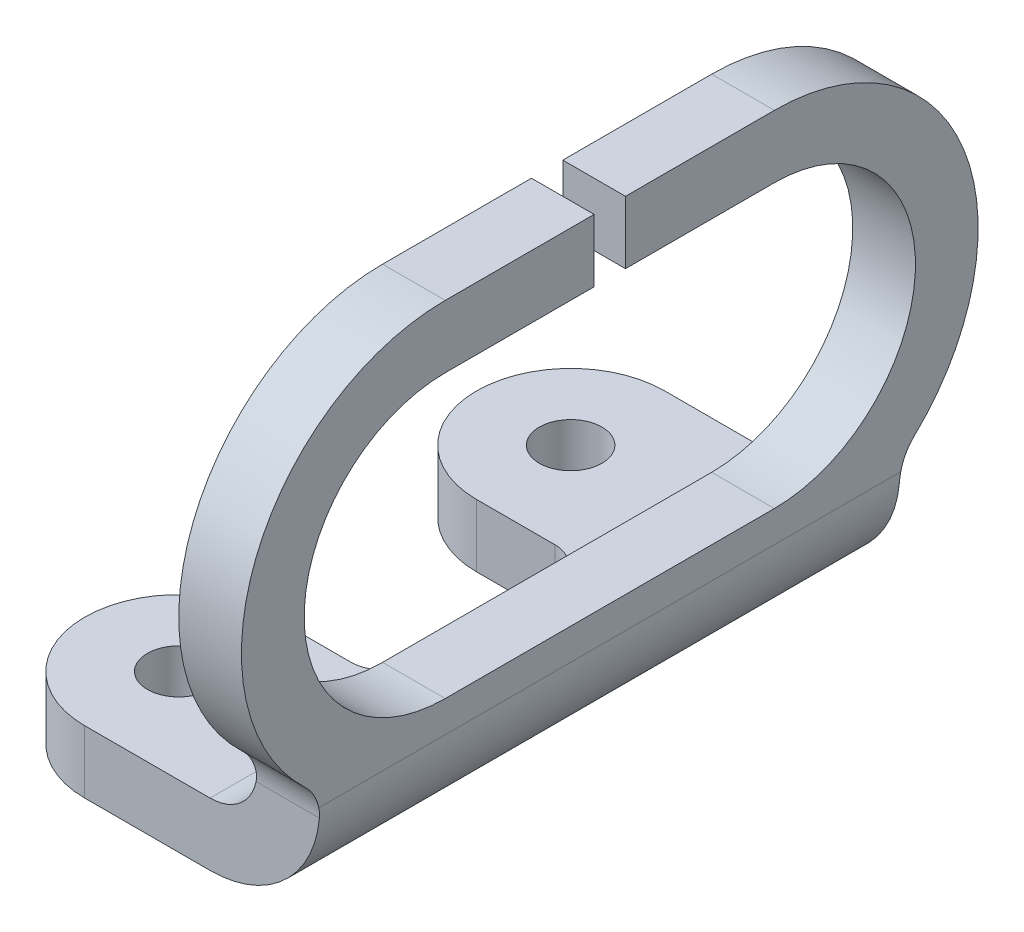
ISO-10303-21;
HEADER;
FILE_DESCRIPTION(('STEP AP214'),'2;1');
FILE_NAME('part.step','',(''),(''),'','','');
FILE_SCHEMA(('AUTOMOTIVE_DESIGN { 1 0 10303 214 1 1 1 1 }'));
ENDSEC;
DATA;
#1=APPLICATION_CONTEXT('core data for automotive mechanical design processes');
#2=APPLICATION_PROTOCOL_DEFINITION('international standard','automotive_design',2000,#1);
#3=PRODUCT_CONTEXT('',#1,'mechanical');
#4=PRODUCT('Part','Part','',(#3));
#5=PRODUCT_RELATED_PRODUCT_CATEGORY('part','',(#4));
#6=PRODUCT_DEFINITION_FORMATION('','',#4);
#7=PRODUCT_DEFINITION_CONTEXT('part definition',#1,'design');
#8=PRODUCT_DEFINITION('design','',#6,#7);
#9=PRODUCT_DEFINITION_SHAPE('','',#8);
#10=(LENGTH_UNIT() NAMED_UNIT(*) SI_UNIT(.MILLI.,.METRE.));
#11=(NAMED_UNIT(*) PLANE_ANGLE_UNIT() SI_UNIT($,.RADIAN.));
#12=(NAMED_UNIT(*) SI_UNIT($,.STERADIAN.) SOLID_ANGLE_UNIT());
#13=UNCERTAINTY_MEASURE_WITH_UNIT(LENGTH_MEASURE(1.E-05),#10,'distance_accuracy_value','');
#14=(GEOMETRIC_REPRESENTATION_CONTEXT(3) GLOBAL_UNCERTAINTY_ASSIGNED_CONTEXT((#13)) GLOBAL_UNIT_ASSIGNED_CONTEXT((#10,
#11,#12)) REPRESENTATION_CONTEXT('',''));
#15=CARTESIAN_POINT('',(0.,0.,0.));
#16=DIRECTION('',(0.,0.,1.));
#17=DIRECTION('',(1.,0.,0.));
#18=AXIS2_PLACEMENT_3D('',#15,#16,#17);
#19=CARTESIAN_POINT('',(27.6479847367362,27.,0.));
#20=DIRECTION('',(0.,1.,0.));
#21=DIRECTION('',(0.,0.,1.));
#22=AXIS2_PLACEMENT_3D('',#19,#20,#21);
#23=PLANE('',#22);
#24=DIRECTION('',(0.,0.,1.));
#25=VECTOR('',#24,1.);
#26=CARTESIAN_POINT('',(33.6479847367362,27.,0.));
#27=LINE('',#26,#25);
#28=CARTESIAN_POINT('',(33.6479847367362,27.,0.999999999999999));
#29=VERTEX_POINT('',#28);
#30=CARTESIAN_POINT('',(33.6479847367362,27.,10.5));
#31=VERTEX_POINT('',#30);
#32=EDGE_CURVE('E271',#29,#31,#27,.T.);
#33=ORIENTED_EDGE('',*,*,#32,.F.);
#34=DIRECTION('',(1.,0.,0.));
#35=VECTOR('',#34,1.);
#36=CARTESIAN_POINT('',(27.6479847367362,27.,0.999999999999999));
#37=LINE('',#36,#35);
#38=CARTESIAN_POINT('',(37.6479847367362,27.,0.999999999999999));
#39=VERTEX_POINT('',#38);
#40=EDGE_CURVE('E256',#29,#39,#37,.T.);
#41=ORIENTED_EDGE('',*,*,#40,.T.);
#42=DIRECTION('',(0.,0.,1.));
#43=VECTOR('',#42,1.);
#44=CARTESIAN_POINT('',(37.6479847367362,27.,0.));
#45=LINE('',#44,#43);
#46=CARTESIAN_POINT('',(37.6479847367362,27.,10.5));
#47=VERTEX_POINT('',#46);
#48=EDGE_CURVE('E269',#39,#47,#45,.T.);
#49=ORIENTED_EDGE('',*,*,#48,.T.);
#50=DIRECTION('',(1.,0.,0.));
#51=VECTOR('',#50,1.);
#52=CARTESIAN_POINT('',(27.6479847367362,27.,10.5));
#53=LINE('',#52,#51);
#54=EDGE_CURVE('E306',#31,#47,#53,.T.);
#55=ORIENTED_EDGE('',*,*,#54,.F.);
#56=EDGE_LOOP('',(#33,#41,#49,#55));
#57=FACE_BOUND('',#56,.T.);
#58=ADVANCED_FACE('F80',(#57),#23,.F.);
#59=CARTESIAN_POINT('',(27.6479847367362,31.,0.));
#60=DIRECTION('',(0.,1.,0.));
#61=DIRECTION('',(0.,0.,1.));
#62=AXIS2_PLACEMENT_3D('',#59,#60,#61);
#63=PLANE('',#62);
#64=DIRECTION('',(1.,0.,0.));
#65=VECTOR('',#64,1.);
#66=CARTESIAN_POINT('',(27.6479847367362,31.,1.));
#67=LINE('',#66,#65);
#68=CARTESIAN_POINT('',(33.6479847367362,31.,1.));
#69=VERTEX_POINT('',#68);
#70=CARTESIAN_POINT('',(37.6479847367362,31.,1.));
#71=VERTEX_POINT('',#70);
#72=EDGE_CURVE('E259',#69,#71,#67,.T.);
#73=ORIENTED_EDGE('',*,*,#72,.F.);
#74=DIRECTION('',(0.,0.,1.));
#75=VECTOR('',#74,1.);
#76=CARTESIAN_POINT('',(33.6479847367362,31.,0.));
#77=LINE('',#76,#75);
#78=CARTESIAN_POINT('',(33.6479847367362,31.,10.5));
#79=VERTEX_POINT('',#78);
#80=EDGE_CURVE('E439',#69,#79,#77,.T.);
#81=ORIENTED_EDGE('',*,*,#80,.T.);
#82=DIRECTION('',(1.,0.,0.));
#83=VECTOR('',#82,1.);
#84=CARTESIAN_POINT('',(27.6479847367362,31.,10.5));
#85=LINE('',#84,#83);
#86=CARTESIAN_POINT('',(37.6479847367362,31.,10.5));
#87=VERTEX_POINT('',#86);
#88=EDGE_CURVE('E609',#79,#87,#85,.T.);
#89=ORIENTED_EDGE('',*,*,#88,.T.);
#90=DIRECTION('',(0.,0.,1.));
#91=VECTOR('',#90,1.);
#92=CARTESIAN_POINT('',(37.6479847367362,31.,0.));
#93=LINE('',#92,#91);
#94=EDGE_CURVE('E590',#71,#87,#93,.T.);
#95=ORIENTED_EDGE('',*,*,#94,.F.);
#96=EDGE_LOOP('',(#73,#81,#89,#95));
#97=FACE_BOUND('',#96,.T.);
#98=ADVANCED_FACE('F615',(#97),#63,.T.);
#99=CARTESIAN_POINT('',(0.,0.,0.));
#100=DIRECTION('',(0.,1.,0.));
#101=DIRECTION('',(0.,0.,1.));
#102=AXIS2_PLACEMENT_3D('',#99,#100,#101);
#103=PLANE('',#102);
#104=CARTESIAN_POINT('',(22.6479847367362,0.,12.5));
#105=DIRECTION('',(0.,1.,0.));
#106=DIRECTION('',(0.,0.,1.));
#107=AXIS2_PLACEMENT_3D('',#104,#105,#106);
#108=CIRCLE('',#107,2.);
#109=CARTESIAN_POINT('',(22.6479847367362,0.,14.5));
#110=VERTEX_POINT('',#109);
#111=EDGE_CURVE('E317',#110,#110,#108,.F.);
#112=ORIENTED_EDGE('',*,*,#111,.F.);
#113=EDGE_LOOP('',(#112));
#114=FACE_BOUND('',#113,.T.);
#115=CARTESIAN_POINT('',(22.6479847367362,0.,-12.5));
#116=DIRECTION('',(0.,1.,0.));
#117=DIRECTION('',(0.,0.,1.));
#118=AXIS2_PLACEMENT_3D('',#115,#116,#117);
#119=CIRCLE('',#118,2.);
#120=CARTESIAN_POINT('',(22.6479847367362,0.,-10.5));
#121=VERTEX_POINT('',#120);
#122=EDGE_CURVE('E375',#121,#121,#119,.T.);
#123=ORIENTED_EDGE('',*,*,#122,.T.);
#124=EDGE_LOOP('',(#123));
#125=FACE_BOUND('',#124,.T.);
#126=DIRECTION('',(1.,0.,0.));
#127=VECTOR('',#126,1.);
#128=CARTESIAN_POINT('',(0.,0.,-18.5));
#129=LINE('',#128,#127);
#130=CARTESIAN_POINT('',(22.6479847367362,0.,-18.5));
#131=VERTEX_POINT('',#130);
#132=CARTESIAN_POINT('',(30.6479847367362,0.,-18.5));
#133=VERTEX_POINT('',#132);
#134=EDGE_CURVE('E302',#131,#133,#129,.T.);
#135=ORIENTED_EDGE('',*,*,#134,.T.);
#136=DIRECTION('',(0.,0.,1.));
#137=VECTOR('',#136,1.);
#138=CARTESIAN_POINT('',(30.6479847367362,0.,18.5));
#139=LINE('',#138,#137);
#140=CARTESIAN_POINT('',(30.6479847367362,0.,18.5));
#141=VERTEX_POINT('',#140);
#142=EDGE_CURVE('E510',#133,#141,#139,.T.);
#143=ORIENTED_EDGE('',*,*,#142,.T.);
#144=DIRECTION('',(1.,0.,0.));
#145=VECTOR('',#144,1.);
#146=CARTESIAN_POINT('',(0.,0.,18.5));
#147=LINE('',#146,#145);
#148=CARTESIAN_POINT('',(22.6479847367362,0.,18.5));
#149=VERTEX_POINT('',#148);
#150=EDGE_CURVE('E371',#149,#141,#147,.T.);
#151=ORIENTED_EDGE('',*,*,#150,.F.);
#152=CARTESIAN_POINT('',(22.6479847367362,0.,12.5));
#153=DIRECTION('',(0.,1.,0.));
#154=DIRECTION('',(0.,0.,1.));
#155=AXIS2_PLACEMENT_3D('',#152,#153,#154);
#156=CIRCLE('',#155,6.);
#157=CARTESIAN_POINT('',(22.6479847367362,0.,6.5));
#158=VERTEX_POINT('',#157);
#159=EDGE_CURVE('E367',#149,#158,#156,.F.);
#160=ORIENTED_EDGE('',*,*,#159,.T.);
#161=DIRECTION('',(1.,0.,0.));
#162=VECTOR('',#161,1.);
#163=CARTESIAN_POINT('',(0.,0.,6.5));
#164=LINE('',#163,#162);
#165=CARTESIAN_POINT('',(27.6479847367362,0.,6.5));
#166=VERTEX_POINT('',#165);
#167=EDGE_CURVE('E363',#158,#166,#164,.T.);
#168=ORIENTED_EDGE('',*,*,#167,.T.);
#169=CARTESIAN_POINT('',(27.6479847367362,0.,4.5));
#170=DIRECTION('',(0.,1.,0.));
#171=DIRECTION('',(0.,0.,1.));
#172=AXIS2_PLACEMENT_3D('',#169,#170,#171);
#173=CIRCLE('',#172,2.);
#174=CARTESIAN_POINT('',(29.6479847367362,0.,4.5));
#175=VERTEX_POINT('',#174);
#176=EDGE_CURVE('E414',#166,#175,#173,.T.);
#177=ORIENTED_EDGE('',*,*,#176,.T.);
#178=DIRECTION('',(0.,0.,1.));
#179=VECTOR('',#178,1.);
#180=CARTESIAN_POINT('',(29.6479847367362,0.,0.));
#181=LINE('',#180,#179);
#182=CARTESIAN_POINT('',(29.6479847367362,0.,-4.5));
#183=VERTEX_POINT('',#182);
#184=EDGE_CURVE('E359',#183,#175,#181,.T.);
#185=ORIENTED_EDGE('',*,*,#184,.F.);
#186=CARTESIAN_POINT('',(27.6479847367362,0.,-4.5));
#187=DIRECTION('',(0.,1.,0.));
#188=DIRECTION('',(0.,0.,1.));
#189=AXIS2_PLACEMENT_3D('',#186,#187,#188);
#190=CIRCLE('',#189,2.);
#191=CARTESIAN_POINT('',(27.6479847367362,0.,-6.5));
#192=VERTEX_POINT('',#191);
#193=EDGE_CURVE('E408',#183,#192,#190,.T.);
#194=ORIENTED_EDGE('',*,*,#193,.T.);
#195=DIRECTION('',(1.,0.,0.));
#196=VECTOR('',#195,1.);
#197=CARTESIAN_POINT('',(0.,0.,-6.5));
#198=LINE('',#197,#196);
#199=CARTESIAN_POINT('',(22.6479847367362,0.,-6.5));
#200=VERTEX_POINT('',#199);
#201=EDGE_CURVE('E355',#200,#192,#198,.T.);
#202=ORIENTED_EDGE('',*,*,#201,.F.);
#203=CARTESIAN_POINT('',(22.6479847367362,0.,-12.5));
#204=DIRECTION('',(0.,1.,0.));
#205=DIRECTION('',(0.,0.,1.));
#206=AXIS2_PLACEMENT_3D('',#203,#204,#205);
#207=CIRCLE('',#206,6.);
#208=EDGE_CURVE('E352',#131,#200,#207,.T.);
#209=ORIENTED_EDGE('',*,*,#208,.F.);
#210=EDGE_LOOP('',(#135,#143,#151,#160,#168,#177,#185,#194,#202,#209));
#211=FACE_BOUND('',#210,.T.);
#212=ADVANCED_FACE('F542',(#114,#125,#211),#103,.F.);
#213=CARTESIAN_POINT('',(0.,4.,-18.5));
#214=DIRECTION('',(0.,0.,-1.));
#215=DIRECTION('',(-1.,0.,0.));
#216=AXIS2_PLACEMENT_3D('',#213,#214,#215);
#217=PLANE('',#216);
#218=DIRECTION('',(-1.,0.,0.));
#219=VECTOR('',#218,1.);
#220=CARTESIAN_POINT('',(37.6479847367362,6.38104996137775,-18.5));
#221=LINE('',#220,#219);
#222=CARTESIAN_POINT('',(33.5834405530771,6.38104996137775,-18.5));
#223=VERTEX_POINT('',#222);
#224=CARTESIAN_POINT('',(37.6205668158293,6.38104996137775,-18.5));
#225=VERTEX_POINT('',#224);
#226=EDGE_CURVE('E452',#223,#225,#221,.F.);
#227=ORIENTED_EDGE('',*,*,#226,.T.);
#228=CARTESIAN_POINT('',(30.6479847367362,7.,-18.5));
#229=DIRECTION('',(0.,0.,-1.));
#230=DIRECTION('',(-1.,0.,0.));
#231=AXIS2_PLACEMENT_3D('',#228,#229,#230);
#232=CIRCLE('',#231,7.);
#233=EDGE_CURVE('E12',#225,#133,#232,.T.);
#234=ORIENTED_EDGE('',*,*,#233,.T.);
#235=ORIENTED_EDGE('',*,*,#134,.F.);
#236=DIRECTION('',(0.,-1.,0.));
#237=VECTOR('',#236,1.);
#238=CARTESIAN_POINT('',(22.6479847367362,4.,-18.5));
#239=LINE('',#238,#237);
#240=CARTESIAN_POINT('',(22.6479847367362,4.,-18.5));
#241=VERTEX_POINT('',#240);
#242=EDGE_CURVE('E391',#241,#131,#239,.T.);
#243=ORIENTED_EDGE('',*,*,#242,.F.);
#244=DIRECTION('',(1.,0.,0.));
#245=VECTOR('',#244,1.);
#246=CARTESIAN_POINT('',(0.,4.,-18.5));
#247=LINE('',#246,#245);
#248=CARTESIAN_POINT('',(30.6479847367362,4.,-18.5));
#249=VERTEX_POINT('',#248);
#250=EDGE_CURVE('E312',#241,#249,#247,.T.);
#251=ORIENTED_EDGE('',*,*,#250,.T.);
#252=CARTESIAN_POINT('',(30.6479847367362,7.,-18.5));
#253=DIRECTION('',(0.,0.,-1.));
#254=DIRECTION('',(-1.,0.,0.));
#255=AXIS2_PLACEMENT_3D('',#252,#253,#254);
#256=CIRCLE('',#255,3.);
#257=EDGE_CURVE('E511',#249,#223,#256,.F.);
#258=ORIENTED_EDGE('',*,*,#257,.T.);
#259=EDGE_LOOP('',(#227,#234,#235,#243,#251,#258));
#260=FACE_BOUND('',#259,.T.);
#261=ADVANCED_FACE('F583',(#260),#217,.T.);
#262=CARTESIAN_POINT('',(22.6479847367362,4.,-12.5));
#263=DIRECTION('',(0.,-1.,0.));
#264=DIRECTION('',(0.,0.,-1.));
#265=AXIS2_PLACEMENT_3D('',#262,#263,#264);
#266=CYLINDRICAL_SURFACE('',#265,6.);
#267=ORIENTED_EDGE('',*,*,#208,.T.);
#268=DIRECTION('',(0.,-1.,0.));
#269=VECTOR('',#268,1.);
#270=CARTESIAN_POINT('',(22.6479847367362,4.,-6.5));
#271=LINE('',#270,#269);
#272=CARTESIAN_POINT('',(22.6479847367362,4.,-6.5));
#273=VERTEX_POINT('',#272);
#274=EDGE_CURVE('E387',#273,#200,#271,.T.);
#275=ORIENTED_EDGE('',*,*,#274,.F.);
#276=CARTESIAN_POINT('',(22.6479847367362,4.,-12.5));
#277=DIRECTION('',(0.,1.,0.));
#278=DIRECTION('',(0.,0.,1.));
#279=AXIS2_PLACEMENT_3D('',#276,#277,#278);
#280=CIRCLE('',#279,6.);
#281=EDGE_CURVE('E316',#241,#273,#280,.T.);
#282=ORIENTED_EDGE('',*,*,#281,.F.);
#283=ORIENTED_EDGE('',*,*,#242,.T.);
#284=EDGE_LOOP('',(#267,#275,#282,#283));
#285=FACE_BOUND('',#284,.T.);
#286=ADVANCED_FACE('F580',(#285),#266,.T.);
#287=CARTESIAN_POINT('',(0.,4.,-6.5));
#288=DIRECTION('',(0.,0.,-1.));
#289=DIRECTION('',(-1.,0.,0.));
#290=AXIS2_PLACEMENT_3D('',#287,#288,#289);
#291=PLANE('',#290);
#292=ORIENTED_EDGE('',*,*,#201,.T.);
#293=DIRECTION('',(0.,-1.,0.));
#294=VECTOR('',#293,1.);
#295=CARTESIAN_POINT('',(27.6479847367362,4.,-6.5));
#296=LINE('',#295,#294);
#297=CARTESIAN_POINT('',(27.6479847367362,4.,-6.5));
#298=VERTEX_POINT('',#297);
#299=EDGE_CURVE('E401',#192,#298,#296,.F.);
#300=ORIENTED_EDGE('',*,*,#299,.T.);
#301=DIRECTION('',(1.,0.,0.));
#302=VECTOR('',#301,1.);
#303=CARTESIAN_POINT('',(0.,4.,-6.5));
#304=LINE('',#303,#302);
#305=EDGE_CURVE('E320',#273,#298,#304,.T.);
#306=ORIENTED_EDGE('',*,*,#305,.F.);
#307=ORIENTED_EDGE('',*,*,#274,.T.);
#308=EDGE_LOOP('',(#292,#300,#306,#307));
#309=FACE_BOUND('',#308,.T.);
#310=ADVANCED_FACE('F576',(#309),#291,.F.);
#311=CARTESIAN_POINT('',(29.6479847367362,4.,0.));
#312=DIRECTION('',(1.,0.,0.));
#313=DIRECTION('',(0.,0.,-1.));
#314=AXIS2_PLACEMENT_3D('',#311,#312,#313);
#315=PLANE('',#314);
#316=DIRECTION('',(0.,0.,1.));
#317=VECTOR('',#316,1.);
#318=CARTESIAN_POINT('',(29.6479847367362,4.,0.));
#319=LINE('',#318,#317);
#320=CARTESIAN_POINT('',(29.6479847367362,4.,-4.5));
#321=VERTEX_POINT('',#320);
#322=CARTESIAN_POINT('',(29.6479847367362,4.,4.5));
#323=VERTEX_POINT('',#322);
#324=EDGE_CURVE('E324',#321,#323,#319,.T.);
#325=ORIENTED_EDGE('',*,*,#324,.F.);
#326=DIRECTION('',(0.,-1.,0.));
#327=VECTOR('',#326,1.);
#328=CARTESIAN_POINT('',(29.6479847367362,0.,-4.5));
#329=LINE('',#328,#327);
#330=EDGE_CURVE('E397',#321,#183,#329,.T.);
#331=ORIENTED_EDGE('',*,*,#330,.T.);
#332=ORIENTED_EDGE('',*,*,#184,.T.);
#333=DIRECTION('',(0.,-1.,0.));
#334=VECTOR('',#333,1.);
#335=CARTESIAN_POINT('',(29.6479847367362,4.,4.5));
#336=LINE('',#335,#334);
#337=EDGE_CURVE('E394',#175,#323,#336,.F.);
#338=ORIENTED_EDGE('',*,*,#337,.T.);
#339=EDGE_LOOP('',(#325,#331,#332,#338));
#340=FACE_BOUND('',#339,.T.);
#341=ADVANCED_FACE('F564',(#340),#315,.F.);
#342=CARTESIAN_POINT('',(0.,4.,6.5));
#343=DIRECTION('',(0.,0.,-1.));
#344=DIRECTION('',(-1.,0.,0.));
#345=AXIS2_PLACEMENT_3D('',#342,#343,#344);
#346=PLANE('',#345);
#347=DIRECTION('',(1.,0.,0.));
#348=VECTOR('',#347,1.);
#349=CARTESIAN_POINT('',(0.,4.,6.5));
#350=LINE('',#349,#348);
#351=CARTESIAN_POINT('',(22.6479847367362,4.,6.5));
#352=VERTEX_POINT('',#351);
#353=CARTESIAN_POINT('',(27.6479847367362,4.,6.5));
#354=VERTEX_POINT('',#353);
#355=EDGE_CURVE('E328',#352,#354,#350,.T.);
#356=ORIENTED_EDGE('',*,*,#355,.T.);
#357=DIRECTION('',(0.,-1.,0.));
#358=VECTOR('',#357,1.);
#359=CARTESIAN_POINT('',(27.6479847367362,4.,6.5));
#360=LINE('',#359,#358);
#361=EDGE_CURVE('E404',#354,#166,#360,.T.);
#362=ORIENTED_EDGE('',*,*,#361,.T.);
#363=ORIENTED_EDGE('',*,*,#167,.F.);
#364=DIRECTION('',(0.,-1.,0.));
#365=VECTOR('',#364,1.);
#366=CARTESIAN_POINT('',(22.6479847367362,4.,6.5));
#367=LINE('',#366,#365);
#368=EDGE_CURVE('E384',#352,#158,#367,.T.);
#369=ORIENTED_EDGE('',*,*,#368,.F.);
#370=EDGE_LOOP('',(#356,#362,#363,#369));
#371=FACE_BOUND('',#370,.T.);
#372=ADVANCED_FACE('F556',(#371),#346,.T.);
#373=CARTESIAN_POINT('',(22.6479847367362,4.,12.5));
#374=DIRECTION('',(0.,-1.,0.));
#375=DIRECTION('',(0.,0.,-1.));
#376=AXIS2_PLACEMENT_3D('',#373,#374,#375);
#377=CYLINDRICAL_SURFACE('',#376,6.);
#378=ORIENTED_EDGE('',*,*,#159,.F.);
#379=DIRECTION('',(0.,-1.,0.));
#380=VECTOR('',#379,1.);
#381=CARTESIAN_POINT('',(22.6479847367362,4.,18.5));
#382=LINE('',#381,#380);
#383=CARTESIAN_POINT('',(22.6479847367362,4.,18.5));
#384=VERTEX_POINT('',#383);
#385=EDGE_CURVE('E348',#384,#149,#382,.T.);
#386=ORIENTED_EDGE('',*,*,#385,.F.);
#387=CARTESIAN_POINT('',(22.6479847367362,4.,12.5));
#388=DIRECTION('',(0.,1.,0.));
#389=DIRECTION('',(0.,0.,1.));
#390=AXIS2_PLACEMENT_3D('',#387,#388,#389);
#391=CIRCLE('',#390,6.);
#392=EDGE_CURVE('E332',#384,#352,#391,.F.);
#393=ORIENTED_EDGE('',*,*,#392,.T.);
#394=ORIENTED_EDGE('',*,*,#368,.T.);
#395=EDGE_LOOP('',(#378,#386,#393,#394));
#396=FACE_BOUND('',#395,.T.);
#397=ADVANCED_FACE('F552',(#396),#377,.T.);
#398=CARTESIAN_POINT('',(0.,4.,18.5));
#399=DIRECTION('',(0.,0.,-1.));
#400=DIRECTION('',(-1.,0.,0.));
#401=AXIS2_PLACEMENT_3D('',#398,#399,#400);
#402=PLANE('',#401);
#403=ORIENTED_EDGE('',*,*,#150,.T.);
#404=CARTESIAN_POINT('',(30.6479847367362,7.,18.5));
#405=DIRECTION('',(0.,0.,-1.));
#406=DIRECTION('',(-1.,0.,0.));
#407=AXIS2_PLACEMENT_3D('',#404,#405,#406);
#408=CIRCLE('',#407,7.);
#409=CARTESIAN_POINT('',(37.6205668158293,6.38104996137775,18.5));
#410=VERTEX_POINT('',#409);
#411=EDGE_CURVE('E532',#141,#410,#408,.F.);
#412=ORIENTED_EDGE('',*,*,#411,.T.);
#413=DIRECTION('',(-1.,0.,0.));
#414=VECTOR('',#413,1.);
#415=CARTESIAN_POINT('',(33.6479847367362,6.38104996137775,18.5));
#416=LINE('',#415,#414);
#417=CARTESIAN_POINT('',(33.5834405530771,6.38104996137775,18.5));
#418=VERTEX_POINT('',#417);
#419=EDGE_CURVE('E462',#410,#418,#416,.T.);
#420=ORIENTED_EDGE('',*,*,#419,.T.);
#421=CARTESIAN_POINT('',(30.6479847367362,7.,18.5));
#422=DIRECTION('',(0.,0.,-1.));
#423=DIRECTION('',(-1.,0.,0.));
#424=AXIS2_PLACEMENT_3D('',#421,#422,#423);
#425=CIRCLE('',#424,3.);
#426=CARTESIAN_POINT('',(30.6479847367362,4.,18.5));
#427=VERTEX_POINT('',#426);
#428=EDGE_CURVE('E493',#418,#427,#425,.T.);
#429=ORIENTED_EDGE('',*,*,#428,.T.);
#430=DIRECTION('',(1.,0.,0.));
#431=VECTOR('',#430,1.);
#432=CARTESIAN_POINT('',(0.,4.,18.5));
#433=LINE('',#432,#431);
#434=EDGE_CURVE('E336',#384,#427,#433,.T.);
#435=ORIENTED_EDGE('',*,*,#434,.F.);
#436=ORIENTED_EDGE('',*,*,#385,.T.);
#437=EDGE_LOOP('',(#403,#412,#420,#429,#435,#436));
#438=FACE_BOUND('',#437,.T.);
#439=ADVANCED_FACE('F548',(#438),#402,.F.);
#440=CARTESIAN_POINT('',(22.6479847367362,4.,-12.5));
#441=DIRECTION('',(0.,-1.,0.));
#442=DIRECTION('',(0.,0.,-1.));
#443=AXIS2_PLACEMENT_3D('',#440,#441,#442);
#444=CYLINDRICAL_SURFACE('',#443,2.);
#445=CARTESIAN_POINT('',(22.6479847367362,4.,-12.5));
#446=DIRECTION('',(0.,1.,0.));
#447=DIRECTION('',(0.,0.,1.));
#448=AXIS2_PLACEMENT_3D('',#445,#446,#447);
#449=CIRCLE('',#448,2.);
#450=CARTESIAN_POINT('',(22.6479847367362,4.,-10.5));
#451=VERTEX_POINT('',#450);
#452=EDGE_CURVE('E340',#451,#451,#449,.T.);
#453=ORIENTED_EDGE('',*,*,#452,.T.);
#454=EDGE_LOOP('',(#453));
#455=FACE_BOUND('',#454,.T.);
#456=ORIENTED_EDGE('',*,*,#122,.F.);
#457=EDGE_LOOP('',(#456));
#458=FACE_BOUND('',#457,.T.);
#459=ADVANCED_FACE('F688',(#455,#458),#444,.F.);
#460=CARTESIAN_POINT('',(22.6479847367362,4.,12.5));
#461=DIRECTION('',(0.,-1.,0.));
#462=DIRECTION('',(0.,0.,-1.));
#463=AXIS2_PLACEMENT_3D('',#460,#461,#462);
#464=CYLINDRICAL_SURFACE('',#463,2.);
#465=CARTESIAN_POINT('',(22.6479847367362,4.,12.5));
#466=DIRECTION('',(0.,1.,0.));
#467=DIRECTION('',(0.,0.,1.));
#468=AXIS2_PLACEMENT_3D('',#465,#466,#467);
#469=CIRCLE('',#468,2.);
#470=CARTESIAN_POINT('',(22.6479847367362,4.,14.5));
#471=VERTEX_POINT('',#470);
#472=EDGE_CURVE('E344',#471,#471,#469,.F.);
#473=ORIENTED_EDGE('',*,*,#472,.F.);
#474=EDGE_LOOP('',(#473));
#475=FACE_BOUND('',#474,.T.);
#476=ORIENTED_EDGE('',*,*,#111,.T.);
#477=EDGE_LOOP('',(#476));
#478=FACE_BOUND('',#477,.T.);
#479=ADVANCED_FACE('F682',(#475,#478),#464,.F.);
#480=CARTESIAN_POINT('',(0.,4.,0.));
#481=DIRECTION('',(0.,1.,0.));
#482=DIRECTION('',(0.,0.,1.));
#483=AXIS2_PLACEMENT_3D('',#480,#481,#482);
#484=PLANE('',#483);
#485=ORIENTED_EDGE('',*,*,#434,.T.);
#486=DIRECTION('',(0.,0.,1.));
#487=VECTOR('',#486,1.);
#488=CARTESIAN_POINT('',(30.6479847367362,4.,0.));
#489=LINE('',#488,#487);
#490=EDGE_CURVE('E482',#427,#249,#489,.F.);
#491=ORIENTED_EDGE('',*,*,#490,.T.);
#492=ORIENTED_EDGE('',*,*,#250,.F.);
#493=ORIENTED_EDGE('',*,*,#281,.T.);
#494=ORIENTED_EDGE('',*,*,#305,.T.);
#495=CARTESIAN_POINT('',(27.6479847367362,4.,-4.5));
#496=DIRECTION('',(0.,1.,0.));
#497=DIRECTION('',(0.,0.,1.));
#498=AXIS2_PLACEMENT_3D('',#495,#496,#497);
#499=CIRCLE('',#498,2.);
#500=EDGE_CURVE('E411',#298,#321,#499,.F.);
#501=ORIENTED_EDGE('',*,*,#500,.T.);
#502=ORIENTED_EDGE('',*,*,#324,.T.);
#503=CARTESIAN_POINT('',(27.6479847367362,4.,4.5));
#504=DIRECTION('',(0.,1.,0.));
#505=DIRECTION('',(0.,0.,1.));
#506=AXIS2_PLACEMENT_3D('',#503,#504,#505);
#507=CIRCLE('',#506,2.);
#508=EDGE_CURVE('E417',#323,#354,#507,.F.);
#509=ORIENTED_EDGE('',*,*,#508,.T.);
#510=ORIENTED_EDGE('',*,*,#355,.F.);
#511=ORIENTED_EDGE('',*,*,#392,.F.);
#512=EDGE_LOOP('',(#485,#491,#492,#493,#494,#501,#502,#509,#510,#511));
#513=FACE_BOUND('',#512,.T.);
#514=ORIENTED_EDGE('',*,*,#452,.F.);
#515=EDGE_LOOP('',(#514));
#516=FACE_BOUND('',#515,.T.);
#517=ORIENTED_EDGE('',*,*,#472,.T.);
#518=EDGE_LOOP('',(#517));
#519=FACE_BOUND('',#518,.T.);
#520=ADVANCED_FACE('F567',(#513,#516,#519),#484,.T.);
#521=CARTESIAN_POINT('',(37.6479847367362,35.,0.));
#522=DIRECTION('',(1.,0.,0.));
#523=DIRECTION('',(0.,0.,-1.));
#524=AXIS2_PLACEMENT_3D('',#521,#522,#523);
#525=PLANE('',#524);
#526=CARTESIAN_POINT('',(37.6479847367362,6.38104996137775,21.5));
#527=DIRECTION('',(1.,0.,0.));
#528=DIRECTION('',(0.,0.,-1.));
#529=AXIS2_PLACEMENT_3D('',#526,#527,#528);
#530=CIRCLE('',#529,3.);
#531=CARTESIAN_POINT('',(37.6479847367362,8.55960309361942,19.4375));
#532=VERTEX_POINT('',#531);
#533=CARTESIAN_POINT('',(37.6479847367362,7.,18.5645441836591));
#534=VERTEX_POINT('',#533);
#535=EDGE_CURVE('E472',#532,#534,#530,.F.);
#536=ORIENTED_EDGE('',*,*,#535,.T.);
#537=DIRECTION('',(0.,0.,1.));
#538=VECTOR('',#537,1.);
#539=CARTESIAN_POINT('',(37.6479847367362,7.,-18.5));
#540=LINE('',#539,#538);
#541=CARTESIAN_POINT('',(37.6479847367362,7.,-18.5645441836591));
#542=VERTEX_POINT('',#541);
#543=EDGE_CURVE('E104',#534,#542,#540,.F.);
#544=ORIENTED_EDGE('',*,*,#543,.T.);
#545=CARTESIAN_POINT('',(37.6479847367362,6.38104996137775,-21.5));
#546=DIRECTION('',(1.,0.,0.));
#547=DIRECTION('',(0.,0.,-1.));
#548=AXIS2_PLACEMENT_3D('',#545,#546,#547);
#549=CIRCLE('',#548,3.);
#550=CARTESIAN_POINT('',(37.6479847367362,8.55960309361942,-19.4375));
#551=VERTEX_POINT('',#550);
#552=EDGE_CURVE('E465',#542,#551,#549,.F.);
#553=ORIENTED_EDGE('',*,*,#552,.T.);
#554=CARTESIAN_POINT('',(37.6479847367362,18.,-10.5));
#555=DIRECTION('',(1.,0.,0.));
#556=DIRECTION('',(0.,0.,-1.));
#557=AXIS2_PLACEMENT_3D('',#554,#555,#556);
#558=CIRCLE('',#557,13.);
#559=CARTESIAN_POINT('',(37.6479847367362,31.,-10.5));
#560=VERTEX_POINT('',#559);
#561=EDGE_CURVE('E607',#551,#560,#558,.T.);
#562=ORIENTED_EDGE('',*,*,#561,.T.);
#563=CARTESIAN_POINT('',(37.6479847367362,31.,-0.999999999999999));
#564=VERTEX_POINT('',#563);
#565=EDGE_CURVE('E598',#560,#564,#93,.T.);
#566=ORIENTED_EDGE('',*,*,#565,.T.);
#567=DIRECTION('',(0.,1.,0.));
#568=VECTOR('',#567,1.);
#569=CARTESIAN_POINT('',(37.6479847367362,35.3492482046733,-0.999999999999998));
#570=LINE('',#569,#568);
#571=CARTESIAN_POINT('',(37.6479847367362,27.,-0.999999999999999));
#572=VERTEX_POINT('',#571);
#573=EDGE_CURVE('E264',#572,#564,#570,.T.);
#574=ORIENTED_EDGE('',*,*,#573,.F.);
#575=CARTESIAN_POINT('',(37.6479847367362,27.,-10.5));
#576=VERTEX_POINT('',#575);
#577=EDGE_CURVE('E281',#576,#572,#45,.T.);
#578=ORIENTED_EDGE('',*,*,#577,.F.);
#579=CARTESIAN_POINT('',(37.6479847367362,18.,-10.5));
#580=DIRECTION('',(1.,0.,0.));
#581=DIRECTION('',(0.,0.,-1.));
#582=AXIS2_PLACEMENT_3D('',#579,#580,#581);
#583=CIRCLE('',#582,9.);
#584=CARTESIAN_POINT('',(37.6479847367362,9.,-10.5));
#585=VERTEX_POINT('',#584);
#586=EDGE_CURVE('E282',#585,#576,#583,.T.);
#587=ORIENTED_EDGE('',*,*,#586,.F.);
#588=DIRECTION('',(0.,0.,-1.));
#589=VECTOR('',#588,1.);
#590=CARTESIAN_POINT('',(37.6479847367362,9.,0.));
#591=LINE('',#590,#589);
#592=CARTESIAN_POINT('',(37.6479847367362,9.,10.5));
#593=VERTEX_POINT('',#592);
#594=EDGE_CURVE('E294',#593,#585,#591,.T.);
#595=ORIENTED_EDGE('',*,*,#594,.F.);
#596=CARTESIAN_POINT('',(37.6479847367362,18.,10.5));
#597=DIRECTION('',(1.,0.,0.));
#598=DIRECTION('',(0.,0.,-1.));
#599=AXIS2_PLACEMENT_3D('',#596,#597,#598);
#600=CIRCLE('',#599,9.);
#601=EDGE_CURVE('E279',#593,#47,#600,.F.);
#602=ORIENTED_EDGE('',*,*,#601,.T.);
#603=ORIENTED_EDGE('',*,*,#48,.F.);
#604=DIRECTION('',(0.,-1.,0.));
#605=VECTOR('',#604,1.);
#606=CARTESIAN_POINT('',(37.6479847367362,35.3492482046733,1.));
#607=LINE('',#606,#605);
#608=EDGE_CURVE('E253',#71,#39,#607,.T.);
#609=ORIENTED_EDGE('',*,*,#608,.F.);
#610=ORIENTED_EDGE('',*,*,#94,.T.);
#611=CARTESIAN_POINT('',(37.6479847367362,18.,10.5));
#612=DIRECTION('',(1.,0.,0.));
#613=DIRECTION('',(0.,0.,-1.));
#614=AXIS2_PLACEMENT_3D('',#611,#612,#613);
#615=CIRCLE('',#614,13.);
#616=EDGE_CURVE('E589',#532,#87,#615,.F.);
#617=ORIENTED_EDGE('',*,*,#616,.F.);
#618=EDGE_LOOP('',(#536,#544,#553,#562,#566,#574,#578,#587,#595,#602,#603,#609,#610,#617));
#619=FACE_BOUND('',#618,.T.);
#620=ADVANCED_FACE('F276',(#619),#525,.T.);
#621=CARTESIAN_POINT('',(33.6479847367362,35.,0.));
#622=DIRECTION('',(1.,0.,0.));
#623=DIRECTION('',(0.,0.,-1.));
#624=AXIS2_PLACEMENT_3D('',#621,#622,#623);
#625=PLANE('',#624);
#626=CARTESIAN_POINT('',(33.6479847367362,6.38104996137775,-21.5));
#627=DIRECTION('',(1.,0.,0.));
#628=DIRECTION('',(0.,0.,-1.));
#629=AXIS2_PLACEMENT_3D('',#626,#627,#628);
#630=CIRCLE('',#629,3.);
#631=CARTESIAN_POINT('',(33.6479847367362,8.55960309361942,-19.4375));
#632=VERTEX_POINT('',#631);
#633=CARTESIAN_POINT('',(33.6479847367362,7.,-18.5645441836591));
#634=VERTEX_POINT('',#633);
#635=EDGE_CURVE('E468',#632,#634,#630,.T.);
#636=ORIENTED_EDGE('',*,*,#635,.T.);
#637=DIRECTION('',(0.,0.,1.));
#638=VECTOR('',#637,1.);
#639=CARTESIAN_POINT('',(33.6479847367362,7.,0.));
#640=LINE('',#639,#638);
#641=CARTESIAN_POINT('',(33.6479847367362,7.,18.5645441836591));
#642=VERTEX_POINT('',#641);
#643=EDGE_CURVE('E478',#634,#642,#640,.T.);
#644=ORIENTED_EDGE('',*,*,#643,.T.);
#645=CARTESIAN_POINT('',(33.6479847367362,6.38104996137775,21.5));
#646=DIRECTION('',(1.,0.,0.));
#647=DIRECTION('',(0.,0.,-1.));
#648=AXIS2_PLACEMENT_3D('',#645,#646,#647);
#649=CIRCLE('',#648,3.);
#650=CARTESIAN_POINT('',(33.6479847367362,8.55960309361942,19.4375));
#651=VERTEX_POINT('',#650);
#652=EDGE_CURVE('E475',#642,#651,#649,.T.);
#653=ORIENTED_EDGE('',*,*,#652,.T.);
#654=CARTESIAN_POINT('',(33.6479847367362,18.,10.5));
#655=DIRECTION('',(1.,0.,0.));
#656=DIRECTION('',(0.,0.,-1.));
#657=AXIS2_PLACEMENT_3D('',#654,#655,#656);
#658=CIRCLE('',#657,13.);
#659=EDGE_CURVE('E436',#651,#79,#658,.F.);
#660=ORIENTED_EDGE('',*,*,#659,.T.);
#661=ORIENTED_EDGE('',*,*,#80,.F.);
#662=DIRECTION('',(0.,-1.,0.));
#663=VECTOR('',#662,1.);
#664=CARTESIAN_POINT('',(33.6479847367362,35.,1.));
#665=LINE('',#664,#663);
#666=EDGE_CURVE('E595',#69,#29,#665,.T.);
#667=ORIENTED_EDGE('',*,*,#666,.T.);
#668=ORIENTED_EDGE('',*,*,#32,.T.);
#669=CARTESIAN_POINT('',(33.6479847367362,18.,10.5));
#670=DIRECTION('',(1.,0.,0.));
#671=DIRECTION('',(0.,0.,-1.));
#672=AXIS2_PLACEMENT_3D('',#669,#670,#671);
#673=CIRCLE('',#672,9.);
#674=CARTESIAN_POINT('',(33.6479847367362,9.,10.5));
#675=VERTEX_POINT('',#674);
#676=EDGE_CURVE('E424',#675,#31,#673,.F.);
#677=ORIENTED_EDGE('',*,*,#676,.F.);
#678=DIRECTION('',(0.,0.,-1.));
#679=VECTOR('',#678,1.);
#680=CARTESIAN_POINT('',(33.6479847367362,9.,0.));
#681=LINE('',#680,#679);
#682=CARTESIAN_POINT('',(33.6479847367362,9.,-10.5));
#683=VERTEX_POINT('',#682);
#684=EDGE_CURVE('E428',#675,#683,#681,.T.);
#685=ORIENTED_EDGE('',*,*,#684,.T.);
#686=CARTESIAN_POINT('',(33.6479847367362,18.,-10.5));
#687=DIRECTION('',(1.,0.,0.));
#688=DIRECTION('',(0.,0.,-1.));
#689=AXIS2_PLACEMENT_3D('',#686,#687,#688);
#690=CIRCLE('',#689,9.);
#691=CARTESIAN_POINT('',(33.6479847367362,27.,-10.5));
#692=VERTEX_POINT('',#691);
#693=EDGE_CURVE('E432',#683,#692,#690,.T.);
#694=ORIENTED_EDGE('',*,*,#693,.T.);
#695=CARTESIAN_POINT('',(33.6479847367362,27.,-0.999999999999999));
#696=VERTEX_POINT('',#695);
#697=EDGE_CURVE('E420',#692,#696,#27,.T.);
#698=ORIENTED_EDGE('',*,*,#697,.T.);
#699=DIRECTION('',(0.,1.,0.));
#700=VECTOR('',#699,1.);
#701=CARTESIAN_POINT('',(33.6479847367362,35.,-0.999999999999998));
#702=LINE('',#701,#700);
#703=CARTESIAN_POINT('',(33.6479847367362,31.,-0.999999999999999));
#704=VERTEX_POINT('',#703);
#705=EDGE_CURVE('E601',#696,#704,#702,.T.);
#706=ORIENTED_EDGE('',*,*,#705,.T.);
#707=CARTESIAN_POINT('',(33.6479847367362,31.,-10.5));
#708=VERTEX_POINT('',#707);
#709=EDGE_CURVE('E440',#708,#704,#77,.T.);
#710=ORIENTED_EDGE('',*,*,#709,.F.);
#711=CARTESIAN_POINT('',(33.6479847367362,18.,-10.5));
#712=DIRECTION('',(1.,0.,0.));
#713=DIRECTION('',(0.,0.,-1.));
#714=AXIS2_PLACEMENT_3D('',#711,#712,#713);
#715=CIRCLE('',#714,13.);
#716=EDGE_CURVE('E444',#632,#708,#715,.T.);
#717=ORIENTED_EDGE('',*,*,#716,.F.);
#718=EDGE_LOOP('',(#636,#644,#653,#660,#661,#667,#668,#677,#685,#694,#698,#706,#710,#717));
#719=FACE_BOUND('',#718,.T.);
#720=ADVANCED_FACE('F622',(#719),#625,.F.);
#721=CARTESIAN_POINT('',(27.6479847367362,4.,-4.5));
#722=DIRECTION('',(0.,1.,0.));
#723=DIRECTION('',(0.,0.,1.));
#724=AXIS2_PLACEMENT_3D('',#721,#722,#723);
#725=CYLINDRICAL_SURFACE('',#724,2.);
#726=ORIENTED_EDGE('',*,*,#500,.F.);
#727=ORIENTED_EDGE('',*,*,#299,.F.);
#728=ORIENTED_EDGE('',*,*,#193,.F.);
#729=ORIENTED_EDGE('',*,*,#330,.F.);
#730=EDGE_LOOP('',(#726,#727,#728,#729));
#731=FACE_BOUND('',#730,.T.);
#732=ADVANCED_FACE('F573',(#731),#725,.F.);
#733=CARTESIAN_POINT('',(27.6479847367362,4.,4.5));
#734=DIRECTION('',(0.,-1.,0.));
#735=DIRECTION('',(0.,0.,-1.));
#736=AXIS2_PLACEMENT_3D('',#733,#734,#735);
#737=CYLINDRICAL_SURFACE('',#736,2.);
#738=ORIENTED_EDGE('',*,*,#508,.F.);
#739=ORIENTED_EDGE('',*,*,#337,.F.);
#740=ORIENTED_EDGE('',*,*,#176,.F.);
#741=ORIENTED_EDGE('',*,*,#361,.F.);
#742=EDGE_LOOP('',(#738,#739,#740,#741));
#743=FACE_BOUND('',#742,.T.);
#744=ADVANCED_FACE('F517',(#743),#737,.F.);
#745=CARTESIAN_POINT('',(27.6479847367362,18.,-10.5));
#746=DIRECTION('',(1.,0.,0.));
#747=DIRECTION('',(0.,0.,-1.));
#748=AXIS2_PLACEMENT_3D('',#745,#746,#747);
#749=CYLINDRICAL_SURFACE('',#748,9.);
#750=DIRECTION('',(1.,0.,0.));
#751=VECTOR('',#750,1.);
#752=CARTESIAN_POINT('',(27.6479847367362,9.,-10.5));
#753=LINE('',#752,#751);
#754=EDGE_CURVE('E299',#683,#585,#753,.T.);
#755=ORIENTED_EDGE('',*,*,#754,.T.);
#756=ORIENTED_EDGE('',*,*,#586,.T.);
#757=DIRECTION('',(1.,0.,0.));
#758=VECTOR('',#757,1.);
#759=CARTESIAN_POINT('',(27.6479847367362,27.,-10.5));
#760=LINE('',#759,#758);
#761=EDGE_CURVE('E298',#692,#576,#760,.T.);
#762=ORIENTED_EDGE('',*,*,#761,.F.);
#763=ORIENTED_EDGE('',*,*,#693,.F.);
#764=EDGE_LOOP('',(#755,#756,#762,#763));
#765=FACE_BOUND('',#764,.T.);
#766=ADVANCED_FACE('F652',(#765),#749,.F.);
#767=CARTESIAN_POINT('',(27.6479847367362,9.,0.));
#768=DIRECTION('',(0.,-1.,0.));
#769=DIRECTION('',(0.,0.,-1.));
#770=AXIS2_PLACEMENT_3D('',#767,#768,#769);
#771=PLANE('',#770);
#772=DIRECTION('',(1.,0.,0.));
#773=VECTOR('',#772,1.);
#774=CARTESIAN_POINT('',(27.6479847367362,9.,10.5));
#775=LINE('',#774,#773);
#776=EDGE_CURVE('E303',#675,#593,#775,.T.);
#777=ORIENTED_EDGE('',*,*,#776,.T.);
#778=ORIENTED_EDGE('',*,*,#594,.T.);
#779=ORIENTED_EDGE('',*,*,#754,.F.);
#780=ORIENTED_EDGE('',*,*,#684,.F.);
#781=EDGE_LOOP('',(#777,#778,#779,#780));
#782=FACE_BOUND('',#781,.T.);
#783=ADVANCED_FACE('F657',(#782),#771,.F.);
#784=CARTESIAN_POINT('',(27.6479847367362,18.,10.5));
#785=DIRECTION('',(1.,0.,0.));
#786=DIRECTION('',(0.,0.,-1.));
#787=AXIS2_PLACEMENT_3D('',#784,#785,#786);
#788=CYLINDRICAL_SURFACE('',#787,9.);
#789=ORIENTED_EDGE('',*,*,#676,.T.);
#790=ORIENTED_EDGE('',*,*,#54,.T.);
#791=ORIENTED_EDGE('',*,*,#601,.F.);
#792=ORIENTED_EDGE('',*,*,#776,.F.);
#793=EDGE_LOOP('',(#789,#790,#791,#792));
#794=FACE_BOUND('',#793,.T.);
#795=ADVANCED_FACE('F659',(#794),#788,.F.);
#796=ORIENTED_EDGE('',*,*,#577,.T.);
#797=DIRECTION('',(1.,0.,0.));
#798=VECTOR('',#797,1.);
#799=CARTESIAN_POINT('',(27.6479847367362,27.,-0.999999999999999));
#800=LINE('',#799,#798);
#801=EDGE_CURVE('E273',#696,#572,#800,.T.);
#802=ORIENTED_EDGE('',*,*,#801,.F.);
#803=ORIENTED_EDGE('',*,*,#697,.F.);
#804=ORIENTED_EDGE('',*,*,#761,.T.);
#805=EDGE_LOOP('',(#796,#802,#803,#804));
#806=FACE_BOUND('',#805,.T.);
#807=ADVANCED_FACE('F649',(#806),#23,.F.);
#808=CARTESIAN_POINT('',(27.6479847367362,18.,-10.5));
#809=DIRECTION('',(1.,0.,0.));
#810=DIRECTION('',(0.,0.,-1.));
#811=AXIS2_PLACEMENT_3D('',#808,#809,#810);
#812=CYLINDRICAL_SURFACE('',#811,13.);
#813=ORIENTED_EDGE('',*,*,#561,.F.);
#814=DIRECTION('',(1.,0.,0.));
#815=VECTOR('',#814,1.);
#816=CARTESIAN_POINT('',(27.6479847367362,8.55960309361942,-19.4375));
#817=LINE('',#816,#815);
#818=EDGE_CURVE('E455',#551,#632,#817,.F.);
#819=ORIENTED_EDGE('',*,*,#818,.T.);
#820=ORIENTED_EDGE('',*,*,#716,.T.);
#821=DIRECTION('',(1.,0.,0.));
#822=VECTOR('',#821,1.);
#823=CARTESIAN_POINT('',(27.6479847367362,31.,-10.5));
#824=LINE('',#823,#822);
#825=EDGE_CURVE('E288',#708,#560,#824,.T.);
#826=ORIENTED_EDGE('',*,*,#825,.T.);
#827=EDGE_LOOP('',(#813,#819,#820,#826));
#828=FACE_BOUND('',#827,.T.);
#829=ADVANCED_FACE('F634',(#828),#812,.T.);
#830=DIRECTION('',(-1.,0.,0.));
#831=VECTOR('',#830,1.);
#832=CARTESIAN_POINT('',(27.6479847367362,31.,-0.999999999999999));
#833=LINE('',#832,#831);
#834=EDGE_CURVE('E447',#564,#704,#833,.T.);
#835=ORIENTED_EDGE('',*,*,#834,.F.);
#836=ORIENTED_EDGE('',*,*,#565,.F.);
#837=ORIENTED_EDGE('',*,*,#825,.F.);
#838=ORIENTED_EDGE('',*,*,#709,.T.);
#839=EDGE_LOOP('',(#835,#836,#837,#838));
#840=FACE_BOUND('',#839,.T.);
#841=ADVANCED_FACE('F640',(#840),#63,.T.);
#842=CARTESIAN_POINT('',(27.6479847367362,18.,10.5));
#843=DIRECTION('',(1.,0.,0.));
#844=DIRECTION('',(0.,0.,-1.));
#845=AXIS2_PLACEMENT_3D('',#842,#843,#844);
#846=CYLINDRICAL_SURFACE('',#845,13.);
#847=ORIENTED_EDGE('',*,*,#659,.F.);
#848=DIRECTION('',(1.,0.,0.));
#849=VECTOR('',#848,1.);
#850=CARTESIAN_POINT('',(27.6479847367362,8.55960309361942,19.4375));
#851=LINE('',#850,#849);
#852=EDGE_CURVE('E458',#651,#532,#851,.T.);
#853=ORIENTED_EDGE('',*,*,#852,.T.);
#854=ORIENTED_EDGE('',*,*,#616,.T.);
#855=ORIENTED_EDGE('',*,*,#88,.F.);
#856=EDGE_LOOP('',(#847,#853,#854,#855));
#857=FACE_BOUND('',#856,.T.);
#858=ADVANCED_FACE('F618',(#857),#846,.T.);
#859=CARTESIAN_POINT('',(27.6479847367362,35.3492482046733,-0.999999999999998));
#860=DIRECTION('',(0.,0.,-1.));
#861=DIRECTION('',(0.,1.,0.));
#862=AXIS2_PLACEMENT_3D('',#859,#860,#861);
#863=PLANE('',#862);
#864=ORIENTED_EDGE('',*,*,#801,.T.);
#865=ORIENTED_EDGE('',*,*,#573,.T.);
#866=ORIENTED_EDGE('',*,*,#834,.T.);
#867=ORIENTED_EDGE('',*,*,#705,.F.);
#868=EDGE_LOOP('',(#864,#865,#866,#867));
#869=FACE_BOUND('',#868,.T.);
#870=ADVANCED_FACE('F750',(#869),#863,.F.);
#871=CARTESIAN_POINT('',(27.6479847367362,35.3492482046733,1.));
#872=DIRECTION('',(0.,0.,1.));
#873=DIRECTION('',(0.,-1.,0.));
#874=AXIS2_PLACEMENT_3D('',#871,#872,#873);
#875=PLANE('',#874);
#876=ORIENTED_EDGE('',*,*,#72,.T.);
#877=ORIENTED_EDGE('',*,*,#608,.T.);
#878=ORIENTED_EDGE('',*,*,#40,.F.);
#879=ORIENTED_EDGE('',*,*,#666,.F.);
#880=EDGE_LOOP('',(#876,#877,#878,#879));
#881=FACE_BOUND('',#880,.T.);
#882=ADVANCED_FACE('F255',(#881),#875,.F.);
#883=CARTESIAN_POINT('',(27.6479847367362,6.38104996137775,-21.5));
#884=DIRECTION('',(1.,0.,0.));
#885=DIRECTION('',(0.,0.,-1.));
#886=AXIS2_PLACEMENT_3D('',#883,#884,#885);
#887=CYLINDRICAL_SURFACE('',#886,3.);
#888=ORIENTED_EDGE('',*,*,#552,.F.);
#889=CARTESIAN_POINT('',(37.6479847367362,7.,-18.5645441836591));
#890=CARTESIAN_POINT('',(37.6479868450742,6.94901917123576,-18.5537925496845));
#891=CARTESIAN_POINT('',(37.6474277975631,6.89775717215538,-18.5443731258949));
#892=CARTESIAN_POINT('',(37.6451699232712,6.79500061298357,-18.5282433036963));
#893=CARTESIAN_POINT('',(37.6434747224244,6.74350730875822,-18.5215243956114));
#894=CARTESIAN_POINT('',(37.6389273426284,6.64029194377404,-18.5107716955678));
#895=CARTESIAN_POINT('',(37.6360751636571,6.58856988301079,-18.5067379036607));
#896=CARTESIAN_POINT('',(37.629201316983,6.48489797209304,-18.5013467048966));
#897=CARTESIAN_POINT('',(37.6251759517673,6.43294792125311,-18.4999978670582));
#898=CARTESIAN_POINT('',(37.6205668158293,6.38104996137775,-18.5));
#899=B_SPLINE_CURVE_WITH_KNOTS('',3,(#889,#890,#891,#892,#893,#894,#895,#896,#897,#898),
.UNSPECIFIED.,.F.,.F.,(4,2,2,2,4),(0.,0.156286288455508,0.312076163011781,0.46786604057121,
0.624152328703098),.UNSPECIFIED.);
#900=EDGE_CURVE('E90',#542,#225,#899,.T.);
#901=ORIENTED_EDGE('',*,*,#900,.T.);
#902=ORIENTED_EDGE('',*,*,#226,.F.);
#903=CARTESIAN_POINT('',(33.5834405530771,6.38104996137775,-18.5));
#904=CARTESIAN_POINT('',(33.594270927209,6.43238414964633,-18.4999938507515));
#905=CARTESIAN_POINT('',(33.6037428197482,6.48400675409856,-18.5013176318486));
#906=CARTESIAN_POINT('',(33.6199124526023,6.58726225723611,-18.5066531083663));
#907=CARTESIAN_POINT('',(33.6266247840134,6.63889361896249,-18.5106503648389));
#908=CARTESIAN_POINT('',(33.6373343718973,6.74215634241526,-18.5213599527228));
#909=CARTESIAN_POINT('',(33.64133162837,6.79378770414164,-18.528072284134));
#910=CARTESIAN_POINT('',(33.6466671048876,6.89704320727919,-18.544241916988));
#911=CARTESIAN_POINT('',(33.6479908859847,6.94866581173142,-18.5537138095272));
#912=CARTESIAN_POINT('',(33.6479847367362,7.,-18.5645441836591));
#913=B_SPLINE_CURVE_WITH_KNOTS('',3,(#903,#904,#905,#906,#907,#908,#909,#910,#911,#912),
.UNSPECIFIED.,.F.,.F.,(4,2,2,2,4),(0.,0.157360332909568,0.313877581591683,0.470394830273796,
0.627755163183365),.UNSPECIFIED.);
#914=EDGE_CURVE('E504',#223,#634,#913,.T.);
#915=ORIENTED_EDGE('',*,*,#914,.T.);
#916=ORIENTED_EDGE('',*,*,#635,.F.);
#917=ORIENTED_EDGE('',*,*,#818,.F.);
#918=EDGE_LOOP('',(#888,#901,#902,#915,#916,#917));
#919=FACE_BOUND('',#918,.T.);
#920=ADVANCED_FACE('F513',(#919),#887,.F.);
#921=CARTESIAN_POINT('',(27.6479847367362,6.38104996137775,21.5));
#922=DIRECTION('',(1.,0.,0.));
#923=DIRECTION('',(0.,0.,-1.));
#924=AXIS2_PLACEMENT_3D('',#921,#922,#923);
#925=CYLINDRICAL_SURFACE('',#924,3.);
#926=ORIENTED_EDGE('',*,*,#419,.F.);
#927=CARTESIAN_POINT('',(37.6205668158293,6.38104996137775,18.5));
#928=CARTESIAN_POINT('',(37.6251759517673,6.43294792125311,18.4999978670582));
#929=CARTESIAN_POINT('',(37.629201316983,6.48489797209304,18.5013467048966));
#930=CARTESIAN_POINT('',(37.6360751636571,6.58856988301079,18.5067379036607));
#931=CARTESIAN_POINT('',(37.6389273426284,6.64029194377404,18.5107716955678));
#932=CARTESIAN_POINT('',(37.6434747224244,6.74350730875822,18.5215243956114));
#933=CARTESIAN_POINT('',(37.6451699232712,6.79500061298357,18.5282433036963));
#934=CARTESIAN_POINT('',(37.6474277975631,6.89775717215538,18.5443731258949));
#935=CARTESIAN_POINT('',(37.6479868450742,6.94901917123576,18.5537925496845));
#936=CARTESIAN_POINT('',(37.6479847367362,7.,18.5645441836591));
#937=B_SPLINE_CURVE_WITH_KNOTS('',3,(#927,#928,#929,#930,#931,#932,#933,#934,#935,#936),
.UNSPECIFIED.,.F.,.F.,(4,2,2,2,4),(0.,0.156286288131888,0.312076165691316,0.467866040247589,
0.624152328703097),.UNSPECIFIED.);
#938=EDGE_CURVE('E527',#410,#534,#937,.T.);
#939=ORIENTED_EDGE('',*,*,#938,.T.);
#940=ORIENTED_EDGE('',*,*,#535,.F.);
#941=ORIENTED_EDGE('',*,*,#852,.F.);
#942=ORIENTED_EDGE('',*,*,#652,.F.);
#943=CARTESIAN_POINT('',(33.6479847367362,7.,18.5645441836591));
#944=CARTESIAN_POINT('',(33.6479908859847,6.94866581173142,18.5537138095272));
#945=CARTESIAN_POINT('',(33.6466671048876,6.89704320727919,18.544241916988));
#946=CARTESIAN_POINT('',(33.64133162837,6.79378770414164,18.528072284134));
#947=CARTESIAN_POINT('',(33.6373343718973,6.74215634241526,18.5213599527228));
#948=CARTESIAN_POINT('',(33.6266247840134,6.63889361896249,18.5106503648389));
#949=CARTESIAN_POINT('',(33.6199124526023,6.58726225723611,18.5066531083663));
#950=CARTESIAN_POINT('',(33.6037428197482,6.48400675409856,18.5013176318486));
#951=CARTESIAN_POINT('',(33.594270927209,6.43238414964633,18.4999938507515));
#952=CARTESIAN_POINT('',(33.5834405530771,6.38104996137775,18.5));
#953=B_SPLINE_CURVE_WITH_KNOTS('',3,(#943,#944,#945,#946,#947,#948,#949,#950,#951,#952),
.UNSPECIFIED.,.F.,.F.,(4,2,2,2,4),(0.,0.157360332909569,0.313877581591683,0.470394830273795,
0.627755163183365),.UNSPECIFIED.);
#954=EDGE_CURVE('E485',#642,#418,#953,.T.);
#955=ORIENTED_EDGE('',*,*,#954,.T.);
#956=EDGE_LOOP('',(#926,#939,#940,#941,#942,#955));
#957=FACE_BOUND('',#956,.T.);
#958=ADVANCED_FACE('F495',(#957),#925,.F.);
#959=CARTESIAN_POINT('',(30.6479847367362,7.,0.));
#960=DIRECTION('',(0.,0.,1.));
#961=DIRECTION('',(1.,0.,0.));
#962=AXIS2_PLACEMENT_3D('',#959,#960,#961);
#963=CYLINDRICAL_SURFACE('',#962,3.);
#964=ORIENTED_EDGE('',*,*,#257,.F.);
#965=ORIENTED_EDGE('',*,*,#490,.F.);
#966=ORIENTED_EDGE('',*,*,#428,.F.);
#967=ORIENTED_EDGE('',*,*,#954,.F.);
#968=ORIENTED_EDGE('',*,*,#643,.F.);
#969=ORIENTED_EDGE('',*,*,#914,.F.);
#970=EDGE_LOOP('',(#964,#965,#966,#967,#968,#969));
#971=FACE_BOUND('',#970,.T.);
#972=ADVANCED_FACE('F498',(#971),#963,.F.);
#973=CARTESIAN_POINT('',(30.6479847367362,7.,0.));
#974=DIRECTION('',(0.,0.,-1.));
#975=DIRECTION('',(-1.,0.,0.));
#976=AXIS2_PLACEMENT_3D('',#973,#974,#975);
#977=CYLINDRICAL_SURFACE('',#976,7.);
#978=ORIENTED_EDGE('',*,*,#900,.F.);
#979=ORIENTED_EDGE('',*,*,#543,.F.);
#980=ORIENTED_EDGE('',*,*,#938,.F.);
#981=ORIENTED_EDGE('',*,*,#411,.F.);
#982=ORIENTED_EDGE('',*,*,#142,.F.);
#983=ORIENTED_EDGE('',*,*,#233,.F.);
#984=EDGE_LOOP('',(#978,#979,#980,#981,#982,#983));
#985=FACE_BOUND('',#984,.T.);
#986=ADVANCED_FACE('F82',(#985),#977,.T.);
#987=CLOSED_SHELL('',(#58,#98,#212,#261,#286,#310,#341,#372,#397,#439,#459,#479,#520,#620,#720,
#732,#744,#766,#783,#795,#807,#829,#841,#858,#870,#882,#920,#958,#972,#986));
#988=MANIFOLD_SOLID_BREP('B2',#987);
#989=ADVANCED_BREP_SHAPE_REPRESENTATION('',(#18,#988),#14);
#990=SHAPE_DEFINITION_REPRESENTATION(#9,#989);
ENDSEC;
END-ISO-10303-21;
